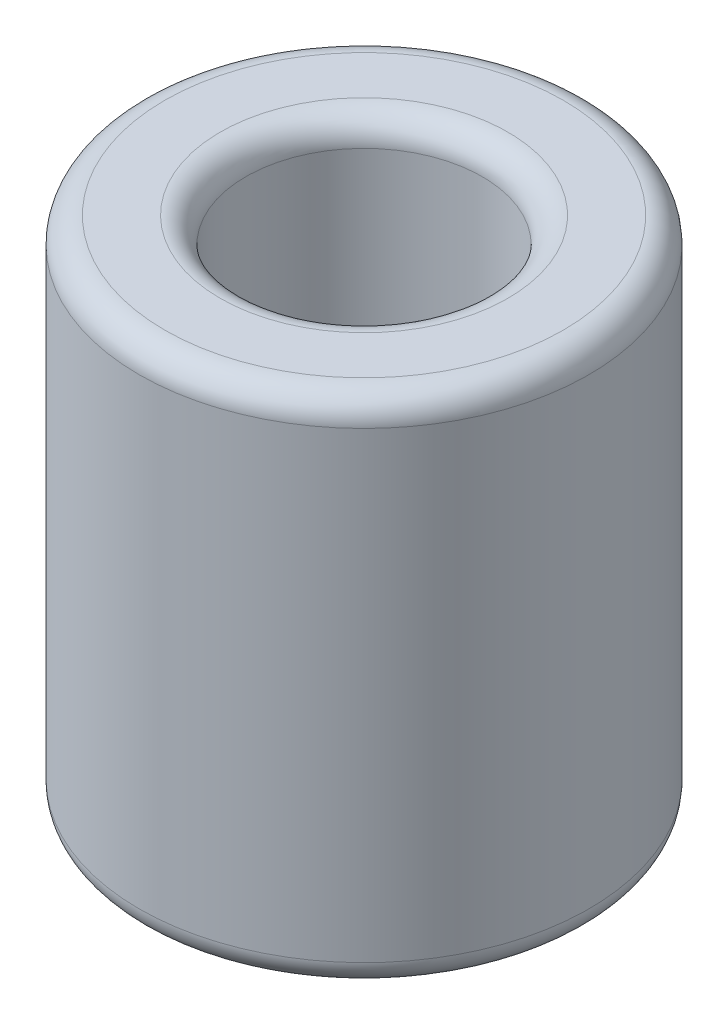
ISO-10303-21;
HEADER;
FILE_DESCRIPTION(('STEP AP214'),'2;1');
FILE_NAME('part.step','',(''),(''),'','','');
FILE_SCHEMA(('AUTOMOTIVE_DESIGN { 1 0 10303 214 1 1 1 1 }'));
ENDSEC;
DATA;
#1=APPLICATION_CONTEXT('core data for automotive mechanical design processes');
#2=APPLICATION_PROTOCOL_DEFINITION('international standard','automotive_design',2000,#1);
#3=PRODUCT_CONTEXT('',#1,'mechanical');
#4=PRODUCT('Part','Part','',(#3));
#5=PRODUCT_RELATED_PRODUCT_CATEGORY('part','',(#4));
#6=PRODUCT_DEFINITION_FORMATION('','',#4);
#7=PRODUCT_DEFINITION_CONTEXT('part definition',#1,'design');
#8=PRODUCT_DEFINITION('design','',#6,#7);
#9=PRODUCT_DEFINITION_SHAPE('','',#8);
#10=(LENGTH_UNIT() NAMED_UNIT(*) SI_UNIT(.MILLI.,.METRE.));
#11=(NAMED_UNIT(*) PLANE_ANGLE_UNIT() SI_UNIT($,.RADIAN.));
#12=(NAMED_UNIT(*) SI_UNIT($,.STERADIAN.) SOLID_ANGLE_UNIT());
#13=UNCERTAINTY_MEASURE_WITH_UNIT(LENGTH_MEASURE(1.E-05),#10,'distance_accuracy_value','');
#14=(GEOMETRIC_REPRESENTATION_CONTEXT(3) GLOBAL_UNCERTAINTY_ASSIGNED_CONTEXT((#13)) GLOBAL_UNIT_ASSIGNED_CONTEXT((#10,
#11,#12)) REPRESENTATION_CONTEXT('',''));
#15=CARTESIAN_POINT('',(0.,0.,0.));
#16=DIRECTION('',(0.,0.,1.));
#17=DIRECTION('',(1.,0.,0.));
#18=AXIS2_PLACEMENT_3D('',#15,#16,#17);
#19=CARTESIAN_POINT('',(0.,10.,0.));
#20=DIRECTION('',(0.,1.,0.));
#21=DIRECTION('',(0.,0.,1.));
#22=AXIS2_PLACEMENT_3D('',#19,#20,#21);
#23=PLANE('',#22);
#24=CARTESIAN_POINT('',(0.,10.,0.));
#25=DIRECTION('',(0.,1.,0.));
#26=DIRECTION('',(0.,0.,1.));
#27=AXIS2_PLACEMENT_3D('',#24,#25,#26);
#28=CIRCLE('',#27,2.8);
#29=CARTESIAN_POINT('',(0.,10.,2.8));
#30=VERTEX_POINT('',#29);
#31=EDGE_CURVE('E10',#30,#30,#28,.F.);
#32=ORIENTED_EDGE('',*,*,#31,.T.);
#33=EDGE_LOOP('',(#32));
#34=FACE_BOUND('',#33,.T.);
#35=CARTESIAN_POINT('',(0.,10.,0.));
#36=DIRECTION('',(0.,1.,0.));
#37=DIRECTION('',(0.,0.,1.));
#38=AXIS2_PLACEMENT_3D('',#35,#36,#37);
#39=CIRCLE('',#38,3.875);
#40=CARTESIAN_POINT('',(0.,10.,3.875));
#41=VERTEX_POINT('',#40);
#42=EDGE_CURVE('E39',#41,#41,#39,.T.);
#43=ORIENTED_EDGE('',*,*,#42,.T.);
#44=EDGE_LOOP('',(#43));
#45=FACE_BOUND('',#44,.T.);
#46=ADVANCED_FACE('F32',(#34,#45),#23,.T.);
#47=CARTESIAN_POINT('',(0.,0.,0.));
#48=DIRECTION('',(0.,1.,0.));
#49=DIRECTION('',(0.,0.,1.));
#50=AXIS2_PLACEMENT_3D('',#47,#48,#49);
#51=PLANE('',#50);
#52=CARTESIAN_POINT('',(0.,0.,0.));
#53=DIRECTION('',(0.,1.,0.));
#54=DIRECTION('',(0.,0.,1.));
#55=AXIS2_PLACEMENT_3D('',#52,#53,#54);
#56=CIRCLE('',#55,2.8);
#57=CARTESIAN_POINT('',(0.,0.,2.8));
#58=VERTEX_POINT('',#57);
#59=EDGE_CURVE('E58',#58,#58,#56,.T.);
#60=ORIENTED_EDGE('',*,*,#59,.T.);
#61=EDGE_LOOP('',(#60));
#62=FACE_BOUND('',#61,.T.);
#63=CARTESIAN_POINT('',(0.,0.,0.));
#64=DIRECTION('',(0.,1.,0.));
#65=DIRECTION('',(0.,0.,1.));
#66=AXIS2_PLACEMENT_3D('',#63,#64,#65);
#67=CIRCLE('',#66,3.875);
#68=CARTESIAN_POINT('',(0.,0.,3.875));
#69=VERTEX_POINT('',#68);
#70=EDGE_CURVE('E61',#69,#69,#67,.F.);
#71=ORIENTED_EDGE('',*,*,#70,.T.);
#72=EDGE_LOOP('',(#71));
#73=FACE_BOUND('',#72,.T.);
#74=ADVANCED_FACE('F65',(#62,#73),#51,.F.);
#75=CARTESIAN_POINT('',(0.,10.,0.));
#76=DIRECTION('',(0.,-1.,0.));
#77=DIRECTION('',(0.,0.,-1.));
#78=AXIS2_PLACEMENT_3D('',#75,#76,#77);
#79=CYLINDRICAL_SURFACE('',#78,4.375);
#80=CARTESIAN_POINT('',(0.,0.5,0.));
#81=DIRECTION('',(0.,1.,0.));
#82=DIRECTION('',(0.,0.,1.));
#83=AXIS2_PLACEMENT_3D('',#80,#81,#82);
#84=CIRCLE('',#83,4.375);
#85=CARTESIAN_POINT('',(0.,0.5,4.375));
#86=VERTEX_POINT('',#85);
#87=EDGE_CURVE('E43',#86,#86,#84,.T.);
#88=ORIENTED_EDGE('',*,*,#87,.T.);
#89=EDGE_LOOP('',(#88));
#90=FACE_BOUND('',#89,.T.);
#91=CARTESIAN_POINT('',(0.,9.5,0.));
#92=DIRECTION('',(0.,1.,0.));
#93=DIRECTION('',(0.,0.,1.));
#94=AXIS2_PLACEMENT_3D('',#91,#92,#93);
#95=CIRCLE('',#94,4.375);
#96=CARTESIAN_POINT('',(0.,9.5,4.375));
#97=VERTEX_POINT('',#96);
#98=EDGE_CURVE('E47',#97,#97,#95,.F.);
#99=ORIENTED_EDGE('',*,*,#98,.T.);
#100=EDGE_LOOP('',(#99));
#101=FACE_BOUND('',#100,.T.);
#102=ADVANCED_FACE('F75',(#90,#101),#79,.T.);
#103=CARTESIAN_POINT('',(0.,10.,0.));
#104=DIRECTION('',(0.,-1.,0.));
#105=DIRECTION('',(0.,0.,-1.));
#106=AXIS2_PLACEMENT_3D('',#103,#104,#105);
#107=CYLINDRICAL_SURFACE('',#106,2.3);
#108=CARTESIAN_POINT('',(0.,0.5,0.));
#109=DIRECTION('',(0.,1.,0.));
#110=DIRECTION('',(0.,0.,1.));
#111=AXIS2_PLACEMENT_3D('',#108,#109,#110);
#112=CIRCLE('',#111,2.3);
#113=CARTESIAN_POINT('',(0.,0.5,2.3));
#114=VERTEX_POINT('',#113);
#115=EDGE_CURVE('E52',#114,#114,#112,.F.);
#116=ORIENTED_EDGE('',*,*,#115,.T.);
#117=EDGE_LOOP('',(#116));
#118=FACE_BOUND('',#117,.T.);
#119=CARTESIAN_POINT('',(0.,9.5,0.));
#120=DIRECTION('',(0.,1.,0.));
#121=DIRECTION('',(0.,0.,1.));
#122=AXIS2_PLACEMENT_3D('',#119,#120,#121);
#123=CIRCLE('',#122,2.3);
#124=CARTESIAN_POINT('',(0.,9.5,2.3));
#125=VERTEX_POINT('',#124);
#126=EDGE_CURVE('E55',#125,#125,#123,.T.);
#127=ORIENTED_EDGE('',*,*,#126,.T.);
#128=EDGE_LOOP('',(#127));
#129=FACE_BOUND('',#128,.T.);
#130=ADVANCED_FACE('F78',(#118,#129),#107,.F.);
#131=CARTESIAN_POINT('',(0.,0.5,0.));
#132=DIRECTION('',(0.,1.,0.));
#133=DIRECTION('',(0.,0.,1.));
#134=AXIS2_PLACEMENT_3D('',#131,#132,#133);
#135=TOROIDAL_SURFACE('',#134,2.8,0.5);
#136=ORIENTED_EDGE('',*,*,#115,.F.);
#137=EDGE_LOOP('',(#136));
#138=FACE_BOUND('',#137,.T.);
#139=ORIENTED_EDGE('',*,*,#59,.F.);
#140=EDGE_LOOP('',(#139));
#141=FACE_BOUND('',#140,.T.);
#142=ADVANCED_FACE('F71',(#138,#141),#135,.T.);
#143=CARTESIAN_POINT('',(0.,0.5,0.));
#144=DIRECTION('',(0.,1.,0.));
#145=DIRECTION('',(0.,0.,1.));
#146=AXIS2_PLACEMENT_3D('',#143,#144,#145);
#147=TOROIDAL_SURFACE('',#146,3.875,0.5);
#148=ORIENTED_EDGE('',*,*,#70,.F.);
#149=EDGE_LOOP('',(#148));
#150=FACE_BOUND('',#149,.T.);
#151=ORIENTED_EDGE('',*,*,#87,.F.);
#152=EDGE_LOOP('',(#151));
#153=FACE_BOUND('',#152,.T.);
#154=ADVANCED_FACE('F67',(#150,#153),#147,.T.);
#155=CARTESIAN_POINT('',(0.,9.5,0.));
#156=DIRECTION('',(0.,1.,0.));
#157=DIRECTION('',(0.,0.,1.));
#158=AXIS2_PLACEMENT_3D('',#155,#156,#157);
#159=TOROIDAL_SURFACE('',#158,2.8,0.5);
#160=ORIENTED_EDGE('',*,*,#31,.F.);
#161=EDGE_LOOP('',(#160));
#162=FACE_BOUND('',#161,.T.);
#163=ORIENTED_EDGE('',*,*,#126,.F.);
#164=EDGE_LOOP('',(#163));
#165=FACE_BOUND('',#164,.T.);
#166=ADVANCED_FACE('F70',(#162,#165),#159,.T.);
#167=CARTESIAN_POINT('',(0.,9.5,0.));
#168=DIRECTION('',(0.,1.,0.));
#169=DIRECTION('',(0.,0.,1.));
#170=AXIS2_PLACEMENT_3D('',#167,#168,#169);
#171=TOROIDAL_SURFACE('',#170,3.875,0.5);
#172=ORIENTED_EDGE('',*,*,#98,.F.);
#173=EDGE_LOOP('',(#172));
#174=FACE_BOUND('',#173,.T.);
#175=ORIENTED_EDGE('',*,*,#42,.F.);
#176=EDGE_LOOP('',(#175));
#177=FACE_BOUND('',#176,.T.);
#178=ADVANCED_FACE('F34',(#174,#177),#171,.T.);
#179=CLOSED_SHELL('',(#46,#74,#102,#130,#142,#154,#166,#178));
#180=MANIFOLD_SOLID_BREP('B2',#179);
#181=ADVANCED_BREP_SHAPE_REPRESENTATION('',(#18,#180),#14);
#182=SHAPE_DEFINITION_REPRESENTATION(#9,#181);
ENDSEC;
END-ISO-10303-21;
